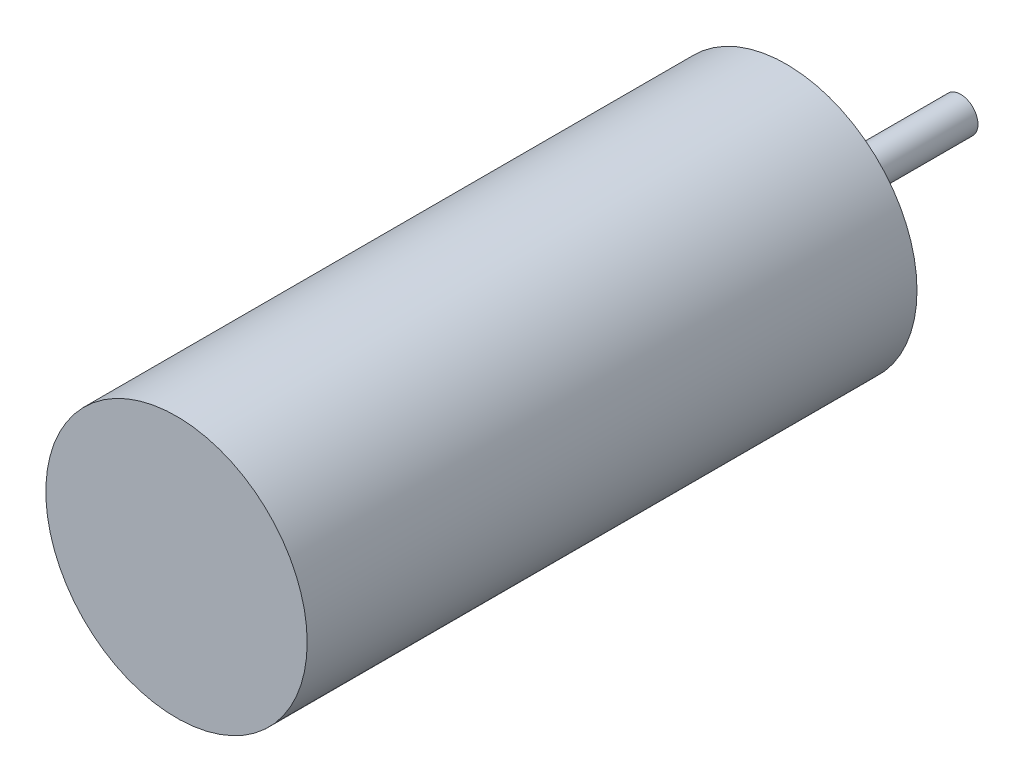
ISO-10303-21;
HEADER;
FILE_DESCRIPTION(('STEP AP214'),'2;1');
FILE_NAME('part.step','',(''),(''),'','','');
FILE_SCHEMA(('AUTOMOTIVE_DESIGN { 1 0 10303 214 1 1 1 1 }'));
ENDSEC;
DATA;
#1=APPLICATION_CONTEXT('core data for automotive mechanical design processes');
#2=APPLICATION_PROTOCOL_DEFINITION('international standard','automotive_design',2000,#1);
#3=PRODUCT_CONTEXT('',#1,'mechanical');
#4=PRODUCT('Part','Part','',(#3));
#5=PRODUCT_RELATED_PRODUCT_CATEGORY('part','',(#4));
#6=PRODUCT_DEFINITION_FORMATION('','',#4);
#7=PRODUCT_DEFINITION_CONTEXT('part definition',#1,'design');
#8=PRODUCT_DEFINITION('design','',#6,#7);
#9=PRODUCT_DEFINITION_SHAPE('','',#8);
#10=(LENGTH_UNIT() NAMED_UNIT(*) SI_UNIT(.MILLI.,.METRE.));
#11=(NAMED_UNIT(*) PLANE_ANGLE_UNIT() SI_UNIT($,.RADIAN.));
#12=(NAMED_UNIT(*) SI_UNIT($,.STERADIAN.) SOLID_ANGLE_UNIT());
#13=UNCERTAINTY_MEASURE_WITH_UNIT(LENGTH_MEASURE(1.E-05),#10,'distance_accuracy_value','');
#14=(GEOMETRIC_REPRESENTATION_CONTEXT(3) GLOBAL_UNCERTAINTY_ASSIGNED_CONTEXT((#13)) GLOBAL_UNIT_ASSIGNED_CONTEXT((#10,
#11,#12)) REPRESENTATION_CONTEXT('',''));
#15=CARTESIAN_POINT('',(0.,0.,0.));
#16=DIRECTION('',(0.,0.,1.));
#17=DIRECTION('',(1.,0.,0.));
#18=AXIS2_PLACEMENT_3D('',#15,#16,#17);
#19=CARTESIAN_POINT('',(0.,0.,14.));
#20=DIRECTION('',(0.,0.,-1.));
#21=DIRECTION('',(-1.,0.,0.));
#22=AXIS2_PLACEMENT_3D('',#19,#20,#21);
#23=CYLINDRICAL_SURFACE('',#22,3.);
#24=CARTESIAN_POINT('',(0.,0.,14.));
#25=DIRECTION('',(0.,0.,1.));
#26=DIRECTION('',(1.,0.,0.));
#27=AXIS2_PLACEMENT_3D('',#24,#25,#26);
#28=CIRCLE('',#27,3.);
#29=CARTESIAN_POINT('',(3.,0.,14.));
#30=VERTEX_POINT('',#29);
#31=EDGE_CURVE('E48',#30,#30,#28,.T.);
#32=ORIENTED_EDGE('',*,*,#31,.F.);
#33=EDGE_LOOP('',(#32));
#34=FACE_BOUND('',#33,.T.);
#35=CARTESIAN_POINT('',(0.,0.,0.));
#36=DIRECTION('',(0.,0.,1.));
#37=DIRECTION('',(1.,0.,0.));
#38=AXIS2_PLACEMENT_3D('',#35,#36,#37);
#39=CIRCLE('',#38,3.);
#40=CARTESIAN_POINT('',(3.,0.,0.));
#41=VERTEX_POINT('',#40);
#42=EDGE_CURVE('E53',#41,#41,#39,.T.);
#43=ORIENTED_EDGE('',*,*,#42,.T.);
#44=EDGE_LOOP('',(#43));
#45=FACE_BOUND('',#44,.T.);
#46=ADVANCED_FACE('F41',(#34,#45),#23,.T.);
#47=CARTESIAN_POINT('',(0.,0.,14.));
#48=DIRECTION('',(0.,0.,1.));
#49=DIRECTION('',(1.,0.,0.));
#50=AXIS2_PLACEMENT_3D('',#47,#48,#49);
#51=PLANE('',#50);
#52=ORIENTED_EDGE('',*,*,#31,.T.);
#53=EDGE_LOOP('',(#52));
#54=FACE_BOUND('',#53,.T.);
#55=ADVANCED_FACE('F76',(#54),#51,.T.);
#56=CARTESIAN_POINT('',(0.,0.,0.));
#57=DIRECTION('',(0.,0.,1.));
#58=DIRECTION('',(1.,0.,0.));
#59=AXIS2_PLACEMENT_3D('',#56,#57,#58);
#60=PLANE('',#59);
#61=CARTESIAN_POINT('',(0.,0.,0.));
#62=DIRECTION('',(0.,0.,1.));
#63=DIRECTION('',(1.,0.,0.));
#64=AXIS2_PLACEMENT_3D('',#61,#62,#63);
#65=CIRCLE('',#64,0.4);
#66=CARTESIAN_POINT('',(0.4,0.,0.));
#67=VERTEX_POINT('',#66);
#68=EDGE_CURVE('E10',#67,#67,#65,.F.);
#69=ORIENTED_EDGE('',*,*,#68,.F.);
#70=EDGE_LOOP('',(#69));
#71=FACE_BOUND('',#70,.T.);
#72=ORIENTED_EDGE('',*,*,#42,.F.);
#73=EDGE_LOOP('',(#72));
#74=FACE_BOUND('',#73,.T.);
#75=ADVANCED_FACE('F69',(#71,#74),#60,.F.);
#76=CARTESIAN_POINT('',(0.,0.,-4.));
#77=DIRECTION('',(0.,0.,1.));
#78=DIRECTION('',(1.,0.,0.));
#79=AXIS2_PLACEMENT_3D('',#76,#77,#78);
#80=CYLINDRICAL_SURFACE('',#79,0.4);
#81=CARTESIAN_POINT('',(0.,0.,-4.));
#82=DIRECTION('',(0.,0.,-1.));
#83=DIRECTION('',(-1.,0.,0.));
#84=AXIS2_PLACEMENT_3D('',#81,#82,#83);
#85=CIRCLE('',#84,0.4);
#86=CARTESIAN_POINT('',(-0.4,0.,-4.));
#87=VERTEX_POINT('',#86);
#88=EDGE_CURVE('E59',#87,#87,#85,.T.);
#89=ORIENTED_EDGE('',*,*,#88,.F.);
#90=EDGE_LOOP('',(#89));
#91=FACE_BOUND('',#90,.T.);
#92=ORIENTED_EDGE('',*,*,#68,.T.);
#93=EDGE_LOOP('',(#92));
#94=FACE_BOUND('',#93,.T.);
#95=ADVANCED_FACE('F67',(#91,#94),#80,.T.);
#96=CARTESIAN_POINT('',(0.,0.,-4.));
#97=DIRECTION('',(0.,0.,-1.));
#98=DIRECTION('',(-1.,0.,0.));
#99=AXIS2_PLACEMENT_3D('',#96,#97,#98);
#100=PLANE('',#99);
#101=ORIENTED_EDGE('',*,*,#88,.T.);
#102=EDGE_LOOP('',(#101));
#103=FACE_BOUND('',#102,.T.);
#104=ADVANCED_FACE('F65',(#103),#100,.T.);
#105=CLOSED_SHELL('',(#46,#55,#75,#95,#104));
#106=MANIFOLD_SOLID_BREP('B2',#105);
#107=ADVANCED_BREP_SHAPE_REPRESENTATION('',(#18,#106),#14);
#108=SHAPE_DEFINITION_REPRESENTATION(#9,#107);
ENDSEC;
END-ISO-10303-21;
